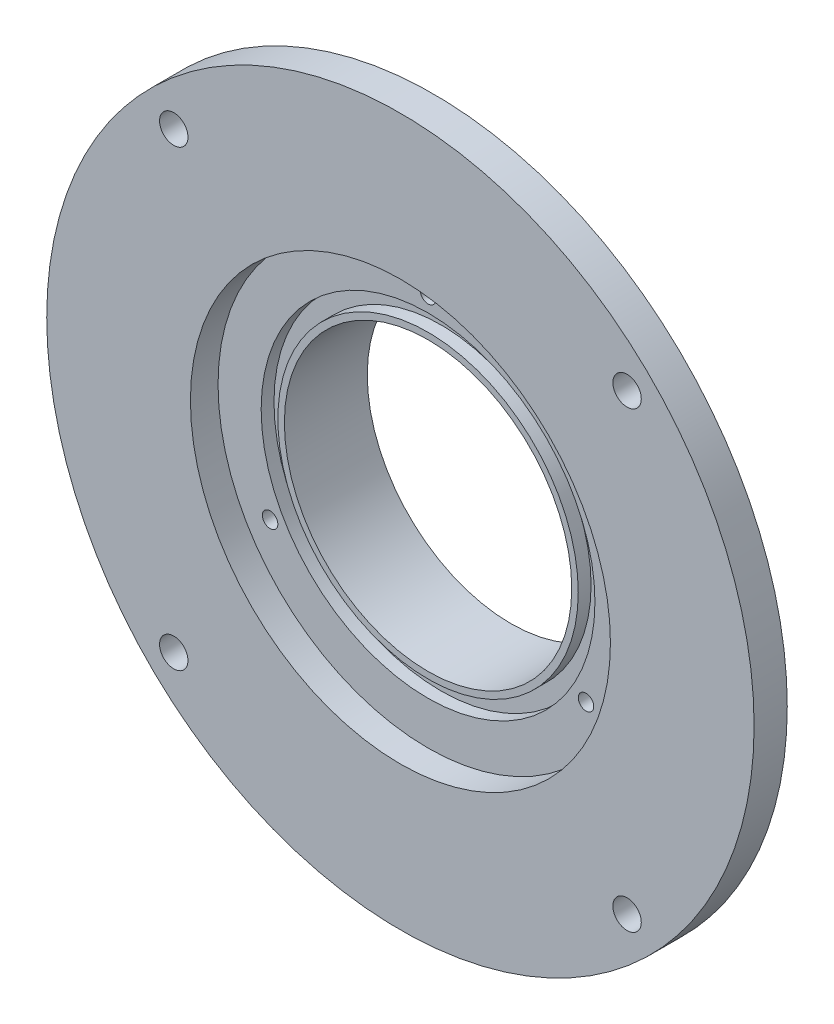
ISO-10303-21;
HEADER;
FILE_DESCRIPTION(('STEP AP214'),'2;1');
FILE_NAME('part.step','',(''),(''),'','','');
FILE_SCHEMA(('AUTOMOTIVE_DESIGN { 1 0 10303 214 1 1 1 1 }'));
ENDSEC;
DATA;
#1=APPLICATION_CONTEXT('core data for automotive mechanical design processes');
#2=APPLICATION_PROTOCOL_DEFINITION('international standard','automotive_design',2000,#1);
#3=PRODUCT_CONTEXT('',#1,'mechanical');
#4=PRODUCT('Part','Part','',(#3));
#5=PRODUCT_RELATED_PRODUCT_CATEGORY('part','',(#4));
#6=PRODUCT_DEFINITION_FORMATION('','',#4);
#7=PRODUCT_DEFINITION_CONTEXT('part definition',#1,'design');
#8=PRODUCT_DEFINITION('design','',#6,#7);
#9=PRODUCT_DEFINITION_SHAPE('','',#8);
#10=(LENGTH_UNIT() NAMED_UNIT(*) SI_UNIT(.MILLI.,.METRE.));
#11=(NAMED_UNIT(*) PLANE_ANGLE_UNIT() SI_UNIT($,.RADIAN.));
#12=(NAMED_UNIT(*) SI_UNIT($,.STERADIAN.) SOLID_ANGLE_UNIT());
#13=UNCERTAINTY_MEASURE_WITH_UNIT(LENGTH_MEASURE(1.E-05),#10,'distance_accuracy_value','');
#14=(GEOMETRIC_REPRESENTATION_CONTEXT(3) GLOBAL_UNCERTAINTY_ASSIGNED_CONTEXT((#13)) GLOBAL_UNIT_ASSIGNED_CONTEXT((#10,
#11,#12)) REPRESENTATION_CONTEXT('',''));
#15=CARTESIAN_POINT('',(0.,0.,0.));
#16=DIRECTION('',(0.,0.,1.));
#17=DIRECTION('',(1.,0.,0.));
#18=AXIS2_PLACEMENT_3D('',#15,#16,#17);
#19=CARTESIAN_POINT('',(0.,0.,0.635));
#20=DIRECTION('',(0.,0.,1.));
#21=DIRECTION('',(1.,0.,0.));
#22=AXIS2_PLACEMENT_3D('',#19,#20,#21);
#23=PLANE('',#22);
#24=CARTESIAN_POINT('',(0.,0.,0.635));
#25=DIRECTION('',(0.,0.,1.));
#26=DIRECTION('',(1.,0.,0.));
#27=AXIS2_PLACEMENT_3D('',#24,#25,#26);
#28=CIRCLE('',#27,16.51);
#29=CARTESIAN_POINT('',(16.51,0.,0.635));
#30=VERTEX_POINT('',#29);
#31=EDGE_CURVE('E44',#30,#30,#28,.F.);
#32=ORIENTED_EDGE('',*,*,#31,.T.);
#33=EDGE_LOOP('',(#32));
#34=FACE_BOUND('',#33,.T.);
#35=CARTESIAN_POINT('',(0.,0.,0.635));
#36=DIRECTION('',(0.,0.,1.));
#37=DIRECTION('',(1.,0.,0.));
#38=AXIS2_PLACEMENT_3D('',#35,#36,#37);
#39=CIRCLE('',#38,17.2593);
#40=CARTESIAN_POINT('',(17.2593,0.,0.635));
#41=VERTEX_POINT('',#40);
#42=EDGE_CURVE('E390',#41,#41,#39,.T.);
#43=ORIENTED_EDGE('',*,*,#42,.T.);
#44=EDGE_LOOP('',(#43));
#45=FACE_BOUND('',#44,.T.);
#46=ADVANCED_FACE('F40',(#34,#45),#23,.T.);
#47=CARTESIAN_POINT('',(0.,0.,-8.89));
#48=DIRECTION('',(0.,0.,1.));
#49=DIRECTION('',(1.,0.,0.));
#50=AXIS2_PLACEMENT_3D('',#47,#48,#49);
#51=CYLINDRICAL_SURFACE('',#50,16.51);
#52=CARTESIAN_POINT('',(0.,0.,-8.89));
#53=DIRECTION('',(0.,0.,1.));
#54=DIRECTION('',(1.,0.,0.));
#55=AXIS2_PLACEMENT_3D('',#52,#53,#54);
#56=CIRCLE('',#55,16.51);
#57=CARTESIAN_POINT('',(16.51,0.,-8.89));
#58=VERTEX_POINT('',#57);
#59=EDGE_CURVE('E94',#58,#58,#56,.T.);
#60=ORIENTED_EDGE('',*,*,#59,.F.);
#61=EDGE_LOOP('',(#60));
#62=FACE_BOUND('',#61,.T.);
#63=ORIENTED_EDGE('',*,*,#31,.F.);
#64=EDGE_LOOP('',(#63));
#65=FACE_BOUND('',#64,.T.);
#66=ADVANCED_FACE('F134',(#62,#65),#51,.F.);
#67=CARTESIAN_POINT('',(0.,0.,0.));
#68=DIRECTION('',(0.,0.,1.));
#69=DIRECTION('',(1.,0.,0.));
#70=AXIS2_PLACEMENT_3D('',#67,#68,#69);
#71=PLANE('',#70);
#72=CARTESIAN_POINT('',(26.0427427511005,26.0427427511006,0.));
#73=DIRECTION('',(0.,0.,1.));
#74=DIRECTION('',(1.,0.,0.));
#75=AXIS2_PLACEMENT_3D('',#72,#73,#74);
#76=CIRCLE('',#75,1.63195);
#77=CARTESIAN_POINT('',(27.6746927511005,26.0427427511006,0.));
#78=VERTEX_POINT('',#77);
#79=EDGE_CURVE('E100',#78,#78,#76,.T.);
#80=ORIENTED_EDGE('',*,*,#79,.T.);
#81=EDGE_LOOP('',(#80));
#82=FACE_BOUND('',#81,.T.);
#83=CARTESIAN_POINT('',(26.0427427511005,-26.0427427511006,0.));
#84=DIRECTION('',(0.,0.,1.));
#85=DIRECTION('',(1.,0.,0.));
#86=AXIS2_PLACEMENT_3D('',#83,#84,#85);
#87=CIRCLE('',#86,1.63195);
#88=CARTESIAN_POINT('',(27.6746927511005,-26.0427427511006,0.));
#89=VERTEX_POINT('',#88);
#90=EDGE_CURVE('E106',#89,#89,#87,.T.);
#91=ORIENTED_EDGE('',*,*,#90,.T.);
#92=EDGE_LOOP('',(#91));
#93=FACE_BOUND('',#92,.T.);
#94=CARTESIAN_POINT('',(-26.0422882155267,26.0431972787413,0.));
#95=DIRECTION('',(0.,0.,1.));
#96=DIRECTION('',(1.,0.,0.));
#97=AXIS2_PLACEMENT_3D('',#94,#95,#96);
#98=CIRCLE('',#97,1.63195);
#99=CARTESIAN_POINT('',(-24.4103382155267,26.0431972787413,0.));
#100=VERTEX_POINT('',#99);
#101=EDGE_CURVE('E112',#100,#100,#98,.T.);
#102=ORIENTED_EDGE('',*,*,#101,.T.);
#103=EDGE_LOOP('',(#102));
#104=FACE_BOUND('',#103,.T.);
#105=CARTESIAN_POINT('',(-26.0425154803386,-26.0429700198791,0.));
#106=DIRECTION('',(0.,0.,1.));
#107=DIRECTION('',(1.,0.,0.));
#108=AXIS2_PLACEMENT_3D('',#105,#106,#107);
#109=CIRCLE('',#108,1.63195);
#110=CARTESIAN_POINT('',(-24.4105654803386,-26.0429700198791,0.));
#111=VERTEX_POINT('',#110);
#112=EDGE_CURVE('E118',#111,#111,#109,.T.);
#113=ORIENTED_EDGE('',*,*,#112,.T.);
#114=EDGE_LOOP('',(#113));
#115=FACE_BOUND('',#114,.T.);
#116=CARTESIAN_POINT('',(0.,0.,0.));
#117=DIRECTION('',(0.,0.,1.));
#118=DIRECTION('',(1.,0.,0.));
#119=AXIS2_PLACEMENT_3D('',#116,#117,#118);
#120=CIRCLE('',#119,40.64);
#121=CARTESIAN_POINT('',(40.64,0.,0.));
#122=VERTEX_POINT('',#121);
#123=EDGE_CURVE('E124',#122,#122,#120,.T.);
#124=ORIENTED_EDGE('',*,*,#123,.F.);
#125=EDGE_LOOP('',(#124));
#126=FACE_BOUND('',#125,.T.);
#127=CARTESIAN_POINT('',(0.,0.,0.));
#128=DIRECTION('',(0.,0.,1.));
#129=DIRECTION('',(1.,0.,0.));
#130=AXIS2_PLACEMENT_3D('',#127,#128,#129);
#131=CIRCLE('',#130,27.94);
#132=CARTESIAN_POINT('',(27.94,0.,0.));
#133=VERTEX_POINT('',#132);
#134=EDGE_CURVE('E11',#133,#133,#131,.F.);
#135=ORIENTED_EDGE('',*,*,#134,.F.);
#136=EDGE_LOOP('',(#135));
#137=FACE_BOUND('',#136,.T.);
#138=ADVANCED_FACE('F131',(#82,#93,#104,#115,#126,#137),#71,.F.);
#139=CARTESIAN_POINT('',(0.,0.,3.81));
#140=DIRECTION('',(0.,0.,-1.));
#141=DIRECTION('',(-1.,0.,0.));
#142=AXIS2_PLACEMENT_3D('',#139,#140,#141);
#143=CYLINDRICAL_SURFACE('',#142,40.64);
#144=CARTESIAN_POINT('',(0.,0.,3.81));
#145=DIRECTION('',(0.,0.,1.));
#146=DIRECTION('',(1.,0.,0.));
#147=AXIS2_PLACEMENT_3D('',#144,#145,#146);
#148=CIRCLE('',#147,40.64);
#149=CARTESIAN_POINT('',(40.64,0.,3.81));
#150=VERTEX_POINT('',#149);
#151=EDGE_CURVE('E49',#150,#150,#148,.T.);
#152=ORIENTED_EDGE('',*,*,#151,.F.);
#153=EDGE_LOOP('',(#152));
#154=FACE_BOUND('',#153,.T.);
#155=ORIENTED_EDGE('',*,*,#123,.T.);
#156=EDGE_LOOP('',(#155));
#157=FACE_BOUND('',#156,.T.);
#158=ADVANCED_FACE('F42',(#154,#157),#143,.T.);
#159=CARTESIAN_POINT('',(0.,0.,3.81));
#160=DIRECTION('',(0.,0.,1.));
#161=DIRECTION('',(1.,0.,0.));
#162=AXIS2_PLACEMENT_3D('',#159,#160,#161);
#163=PLANE('',#162);
#164=CARTESIAN_POINT('',(0.,0.,3.81));
#165=DIRECTION('',(0.,0.,1.));
#166=DIRECTION('',(1.,0.,0.));
#167=AXIS2_PLACEMENT_3D('',#164,#165,#166);
#168=CIRCLE('',#167,24.13);
#169=CARTESIAN_POINT('',(24.13,0.,3.81));
#170=VERTEX_POINT('',#169);
#171=EDGE_CURVE('E88',#170,#170,#168,.T.);
#172=ORIENTED_EDGE('',*,*,#171,.F.);
#173=EDGE_LOOP('',(#172));
#174=FACE_BOUND('',#173,.T.);
#175=CARTESIAN_POINT('',(26.0427427511005,26.0427427511006,3.81));
#176=DIRECTION('',(0.,0.,1.));
#177=DIRECTION('',(1.,0.,0.));
#178=AXIS2_PLACEMENT_3D('',#175,#176,#177);
#179=CIRCLE('',#178,1.63195);
#180=CARTESIAN_POINT('',(27.6746927511005,26.0427427511006,3.81));
#181=VERTEX_POINT('',#180);
#182=EDGE_CURVE('E103',#181,#181,#179,.T.);
#183=ORIENTED_EDGE('',*,*,#182,.F.);
#184=EDGE_LOOP('',(#183));
#185=FACE_BOUND('',#184,.T.);
#186=CARTESIAN_POINT('',(26.0427427511005,-26.0427427511006,3.81));
#187=DIRECTION('',(0.,0.,1.));
#188=DIRECTION('',(1.,0.,0.));
#189=AXIS2_PLACEMENT_3D('',#186,#187,#188);
#190=CIRCLE('',#189,1.63195);
#191=CARTESIAN_POINT('',(27.6746927511005,-26.0427427511006,3.81));
#192=VERTEX_POINT('',#191);
#193=EDGE_CURVE('E109',#192,#192,#190,.T.);
#194=ORIENTED_EDGE('',*,*,#193,.F.);
#195=EDGE_LOOP('',(#194));
#196=FACE_BOUND('',#195,.T.);
#197=CARTESIAN_POINT('',(-26.0422882155267,26.0431972787413,3.81));
#198=DIRECTION('',(0.,0.,1.));
#199=DIRECTION('',(1.,0.,0.));
#200=AXIS2_PLACEMENT_3D('',#197,#198,#199);
#201=CIRCLE('',#200,1.63195);
#202=CARTESIAN_POINT('',(-24.4103382155267,26.0431972787413,3.81));
#203=VERTEX_POINT('',#202);
#204=EDGE_CURVE('E115',#203,#203,#201,.T.);
#205=ORIENTED_EDGE('',*,*,#204,.F.);
#206=EDGE_LOOP('',(#205));
#207=FACE_BOUND('',#206,.T.);
#208=CARTESIAN_POINT('',(-26.0425154803386,-26.0429700198791,3.81));
#209=DIRECTION('',(0.,0.,1.));
#210=DIRECTION('',(1.,0.,0.));
#211=AXIS2_PLACEMENT_3D('',#208,#209,#210);
#212=CIRCLE('',#211,1.63195);
#213=CARTESIAN_POINT('',(-24.4105654803386,-26.0429700198791,3.81));
#214=VERTEX_POINT('',#213);
#215=EDGE_CURVE('E121',#214,#214,#212,.T.);
#216=ORIENTED_EDGE('',*,*,#215,.F.);
#217=EDGE_LOOP('',(#216));
#218=FACE_BOUND('',#217,.T.);
#219=ORIENTED_EDGE('',*,*,#151,.T.);
#220=EDGE_LOOP('',(#219));
#221=FACE_BOUND('',#220,.T.);
#222=ADVANCED_FACE('F189',(#174,#185,#196,#207,#218,#221),#163,.T.);
#223=CARTESIAN_POINT('',(-26.0425154803386,-26.0429700198791,3.81));
#224=DIRECTION('',(0.,0.,1.));
#225=DIRECTION('',(1.,0.,0.));
#226=AXIS2_PLACEMENT_3D('',#223,#224,#225);
#227=CYLINDRICAL_SURFACE('',#226,1.63195);
#228=ORIENTED_EDGE('',*,*,#112,.F.);
#229=EDGE_LOOP('',(#228));
#230=FACE_BOUND('',#229,.T.);
#231=ORIENTED_EDGE('',*,*,#215,.T.);
#232=EDGE_LOOP('',(#231));
#233=FACE_BOUND('',#232,.T.);
#234=ADVANCED_FACE('F192',(#230,#233),#227,.F.);
#235=CARTESIAN_POINT('',(-26.0422882155267,26.0431972787413,3.81));
#236=DIRECTION('',(0.,0.,1.));
#237=DIRECTION('',(1.,0.,0.));
#238=AXIS2_PLACEMENT_3D('',#235,#236,#237);
#239=CYLINDRICAL_SURFACE('',#238,1.63195);
#240=ORIENTED_EDGE('',*,*,#101,.F.);
#241=EDGE_LOOP('',(#240));
#242=FACE_BOUND('',#241,.T.);
#243=ORIENTED_EDGE('',*,*,#204,.T.);
#244=EDGE_LOOP('',(#243));
#245=FACE_BOUND('',#244,.T.);
#246=ADVANCED_FACE('F221',(#242,#245),#239,.F.);
#247=CARTESIAN_POINT('',(26.0427427511005,-26.0427427511006,3.81));
#248=DIRECTION('',(0.,0.,1.));
#249=DIRECTION('',(1.,0.,0.));
#250=AXIS2_PLACEMENT_3D('',#247,#248,#249);
#251=CYLINDRICAL_SURFACE('',#250,1.63195);
#252=ORIENTED_EDGE('',*,*,#90,.F.);
#253=EDGE_LOOP('',(#252));
#254=FACE_BOUND('',#253,.T.);
#255=ORIENTED_EDGE('',*,*,#193,.T.);
#256=EDGE_LOOP('',(#255));
#257=FACE_BOUND('',#256,.T.);
#258=ADVANCED_FACE('F151',(#254,#257),#251,.F.);
#259=CARTESIAN_POINT('',(26.0427427511005,26.0427427511006,3.81));
#260=DIRECTION('',(0.,0.,1.));
#261=DIRECTION('',(1.,0.,0.));
#262=AXIS2_PLACEMENT_3D('',#259,#260,#261);
#263=CYLINDRICAL_SURFACE('',#262,1.63195);
#264=ORIENTED_EDGE('',*,*,#79,.F.);
#265=EDGE_LOOP('',(#264));
#266=FACE_BOUND('',#265,.T.);
#267=ORIENTED_EDGE('',*,*,#182,.T.);
#268=EDGE_LOOP('',(#267));
#269=FACE_BOUND('',#268,.T.);
#270=ADVANCED_FACE('F141',(#266,#269),#263,.F.);
#271=CARTESIAN_POINT('',(0.,0.,-8.89));
#272=DIRECTION('',(0.,0.,1.));
#273=DIRECTION('',(1.,0.,0.));
#274=AXIS2_PLACEMENT_3D('',#271,#272,#273);
#275=CYLINDRICAL_SURFACE('',#274,27.94);
#276=CARTESIAN_POINT('',(0.,0.,-8.89));
#277=DIRECTION('',(0.,0.,-1.));
#278=DIRECTION('',(-1.,0.,0.));
#279=AXIS2_PLACEMENT_3D('',#276,#277,#278);
#280=CIRCLE('',#279,27.94);
#281=CARTESIAN_POINT('',(-27.94,0.,-8.89));
#282=VERTEX_POINT('',#281);
#283=EDGE_CURVE('E97',#282,#282,#280,.T.);
#284=ORIENTED_EDGE('',*,*,#283,.F.);
#285=EDGE_LOOP('',(#284));
#286=FACE_BOUND('',#285,.T.);
#287=ORIENTED_EDGE('',*,*,#134,.T.);
#288=EDGE_LOOP('',(#287));
#289=FACE_BOUND('',#288,.T.);
#290=ADVANCED_FACE('F138',(#286,#289),#275,.T.);
#291=CARTESIAN_POINT('',(0.,0.,-8.89));
#292=DIRECTION('',(0.,0.,-1.));
#293=DIRECTION('',(-1.,0.,0.));
#294=AXIS2_PLACEMENT_3D('',#291,#292,#293);
#295=PLANE('',#294);
#296=ORIENTED_EDGE('',*,*,#59,.T.);
#297=EDGE_LOOP('',(#296));
#298=FACE_BOUND('',#297,.T.);
#299=ORIENTED_EDGE('',*,*,#283,.T.);
#300=EDGE_LOOP('',(#299));
#301=FACE_BOUND('',#300,.T.);
#302=ADVANCED_FACE('F140',(#298,#301),#295,.T.);
#303=CARTESIAN_POINT('',(0.,0.,0.635));
#304=DIRECTION('',(0.,0.,1.));
#305=DIRECTION('',(1.,0.,0.));
#306=AXIS2_PLACEMENT_3D('',#303,#304,#305);
#307=CIRCLE('',#306,19.177);
#308=CARTESIAN_POINT('',(19.177,0.,0.635));
#309=VERTEX_POINT('',#308);
#310=EDGE_CURVE('E178',#309,#309,#307,.T.);
#311=ORIENTED_EDGE('',*,*,#310,.F.);
#312=EDGE_LOOP('',(#311));
#313=FACE_BOUND('',#312,.T.);
#314=CARTESIAN_POINT('',(-18.147562336303,-10.4774999999998,0.635000000000001));
#315=DIRECTION('',(0.,0.,1.));
#316=DIRECTION('',(1.,0.,0.));
#317=AXIS2_PLACEMENT_3D('',#314,#315,#316);
#318=CIRCLE('',#317,0.888999999999987);
#319=CARTESIAN_POINT('',(-17.258562336303,-10.4774999999998,0.635000000000001));
#320=VERTEX_POINT('',#319);
#321=EDGE_CURVE('E70',#320,#320,#318,.T.);
#322=ORIENTED_EDGE('',*,*,#321,.F.);
#323=EDGE_LOOP('',(#322));
#324=FACE_BOUND('',#323,.T.);
#325=CARTESIAN_POINT('',(18.1475623363029,-10.4775000000001,0.635000000000001));
#326=DIRECTION('',(0.,0.,1.));
#327=DIRECTION('',(1.,0.,0.));
#328=AXIS2_PLACEMENT_3D('',#325,#326,#327);
#329=CIRCLE('',#328,0.888999999999987);
#330=CARTESIAN_POINT('',(19.0365623363029,-10.4775000000001,0.635000000000001));
#331=VERTEX_POINT('',#330);
#332=EDGE_CURVE('E69',#331,#331,#329,.T.);
#333=ORIENTED_EDGE('',*,*,#332,.F.);
#334=EDGE_LOOP('',(#333));
#335=FACE_BOUND('',#334,.T.);
#336=CARTESIAN_POINT('',(0.,20.955,0.635000000000001));
#337=DIRECTION('',(0.,0.,1.));
#338=DIRECTION('',(1.,0.,0.));
#339=AXIS2_PLACEMENT_3D('',#336,#337,#338);
#340=CIRCLE('',#339,0.888999999999989);
#341=CARTESIAN_POINT('',(0.888999999999989,20.955,0.635000000000001));
#342=VERTEX_POINT('',#341);
#343=EDGE_CURVE('E82',#342,#342,#340,.T.);
#344=ORIENTED_EDGE('',*,*,#343,.F.);
#345=EDGE_LOOP('',(#344));
#346=FACE_BOUND('',#345,.T.);
#347=CARTESIAN_POINT('',(0.,0.,0.635));
#348=DIRECTION('',(0.,0.,1.));
#349=DIRECTION('',(1.,0.,0.));
#350=AXIS2_PLACEMENT_3D('',#347,#348,#349);
#351=CIRCLE('',#350,24.13);
#352=CARTESIAN_POINT('',(24.13,0.,0.635));
#353=VERTEX_POINT('',#352);
#354=EDGE_CURVE('E89',#353,#353,#351,.T.);
#355=ORIENTED_EDGE('',*,*,#354,.T.);
#356=EDGE_LOOP('',(#355));
#357=FACE_BOUND('',#356,.T.);
#358=ADVANCED_FACE('F148',(#313,#324,#335,#346,#357),#23,.T.);
#359=CARTESIAN_POINT('',(0.,0.,0.635));
#360=DIRECTION('',(0.,0.,1.));
#361=DIRECTION('',(1.,0.,0.));
#362=AXIS2_PLACEMENT_3D('',#359,#360,#361);
#363=CYLINDRICAL_SURFACE('',#362,24.13);
#364=ORIENTED_EDGE('',*,*,#354,.F.);
#365=EDGE_LOOP('',(#364));
#366=FACE_BOUND('',#365,.T.);
#367=ORIENTED_EDGE('',*,*,#171,.T.);
#368=EDGE_LOOP('',(#367));
#369=FACE_BOUND('',#368,.T.);
#370=ADVANCED_FACE('F168',(#366,#369),#363,.F.);
#371=CARTESIAN_POINT('',(0.,20.955,-3.7846));
#372=DIRECTION('',(0.,0.,1.));
#373=DIRECTION('',(1.,0.,0.));
#374=AXIS2_PLACEMENT_3D('',#371,#372,#373);
#375=CONICAL_SURFACE('',#374,0.888999999999988,1.02974425867665);
#376=CARTESIAN_POINT('',(0.,20.955,-4.31876509031549));
#377=VERTEX_POINT('',#376);
#378=VERTEX_LOOP('',#377);
#379=FACE_BOUND('',#378,.T.);
#380=CARTESIAN_POINT('',(0.,20.955,-3.7846));
#381=DIRECTION('',(0.,0.,1.));
#382=DIRECTION('',(1.,0.,0.));
#383=AXIS2_PLACEMENT_3D('',#380,#381,#382);
#384=CIRCLE('',#383,0.888999999999988);
#385=CARTESIAN_POINT('',(0.888999999999988,20.955,-3.7846));
#386=VERTEX_POINT('',#385);
#387=EDGE_CURVE('E85',#386,#386,#384,.T.);
#388=ORIENTED_EDGE('',*,*,#387,.T.);
#389=EDGE_LOOP('',(#388));
#390=FACE_BOUND('',#389,.T.);
#391=ADVANCED_FACE('F173',(#379,#390),#375,.F.);
#392=CARTESIAN_POINT('',(0.,20.955,0.635));
#393=DIRECTION('',(0.,0.,1.));
#394=DIRECTION('',(1.,0.,0.));
#395=AXIS2_PLACEMENT_3D('',#392,#393,#394);
#396=CYLINDRICAL_SURFACE('',#395,0.888999999999988);
#397=ORIENTED_EDGE('',*,*,#387,.F.);
#398=EDGE_LOOP('',(#397));
#399=FACE_BOUND('',#398,.T.);
#400=ORIENTED_EDGE('',*,*,#343,.T.);
#401=EDGE_LOOP('',(#400));
#402=FACE_BOUND('',#401,.T.);
#403=ADVANCED_FACE('F279',(#399,#402),#396,.F.);
#404=CARTESIAN_POINT('',(18.1475623363029,-10.4775000000001,-3.7846));
#405=DIRECTION('',(0.,0.,1.));
#406=DIRECTION('',(1.,0.,0.));
#407=AXIS2_PLACEMENT_3D('',#404,#405,#406);
#408=CONICAL_SURFACE('',#407,0.888999999999987,1.02974425867665);
#409=CARTESIAN_POINT('',(18.1475623363029,-10.4775000000001,-4.31876509031549));
#410=VERTEX_POINT('',#409);
#411=VERTEX_LOOP('',#410);
#412=FACE_BOUND('',#411,.T.);
#413=CARTESIAN_POINT('',(18.1475623363029,-10.4775000000001,-3.7846));
#414=DIRECTION('',(0.,0.,1.));
#415=DIRECTION('',(1.,0.,0.));
#416=AXIS2_PLACEMENT_3D('',#413,#414,#415);
#417=CIRCLE('',#416,0.888999999999987);
#418=CARTESIAN_POINT('',(19.0365623363029,-10.4775000000001,-3.7846));
#419=VERTEX_POINT('',#418);
#420=EDGE_CURVE('E73',#419,#419,#417,.T.);
#421=ORIENTED_EDGE('',*,*,#420,.T.);
#422=EDGE_LOOP('',(#421));
#423=FACE_BOUND('',#422,.T.);
#424=ADVANCED_FACE('F286',(#412,#423),#408,.F.);
#425=CARTESIAN_POINT('',(18.1475623363029,-10.4775000000001,0.635));
#426=DIRECTION('',(0.,0.,1.));
#427=DIRECTION('',(1.,0.,0.));
#428=AXIS2_PLACEMENT_3D('',#425,#426,#427);
#429=CYLINDRICAL_SURFACE('',#428,0.888999999999987);
#430=ORIENTED_EDGE('',*,*,#420,.F.);
#431=EDGE_LOOP('',(#430));
#432=FACE_BOUND('',#431,.T.);
#433=ORIENTED_EDGE('',*,*,#332,.T.);
#434=EDGE_LOOP('',(#433));
#435=FACE_BOUND('',#434,.T.);
#436=ADVANCED_FACE('F63',(#432,#435),#429,.F.);
#437=CARTESIAN_POINT('',(-18.147562336303,-10.4774999999998,-3.7846));
#438=DIRECTION('',(0.,0.,1.));
#439=DIRECTION('',(1.,0.,0.));
#440=AXIS2_PLACEMENT_3D('',#437,#438,#439);
#441=CONICAL_SURFACE('',#440,0.888999999999987,1.02974425867665);
#442=CARTESIAN_POINT('',(-18.147562336303,-10.4774999999998,-4.31876509031549));
#443=VERTEX_POINT('',#442);
#444=VERTEX_LOOP('',#443);
#445=FACE_BOUND('',#444,.T.);
#446=CARTESIAN_POINT('',(-18.147562336303,-10.4774999999998,-3.7846));
#447=DIRECTION('',(0.,0.,1.));
#448=DIRECTION('',(1.,0.,0.));
#449=AXIS2_PLACEMENT_3D('',#446,#447,#448);
#450=CIRCLE('',#449,0.888999999999987);
#451=CARTESIAN_POINT('',(-17.258562336303,-10.4774999999998,-3.7846));
#452=VERTEX_POINT('',#451);
#453=EDGE_CURVE('E67',#452,#452,#450,.T.);
#454=ORIENTED_EDGE('',*,*,#453,.T.);
#455=EDGE_LOOP('',(#454));
#456=FACE_BOUND('',#455,.T.);
#457=ADVANCED_FACE('F59',(#445,#456),#441,.F.);
#458=CARTESIAN_POINT('',(-18.147562336303,-10.4774999999998,0.635));
#459=DIRECTION('',(0.,0.,1.));
#460=DIRECTION('',(1.,0.,0.));
#461=AXIS2_PLACEMENT_3D('',#458,#459,#460);
#462=CYLINDRICAL_SURFACE('',#461,0.888999999999987);
#463=ORIENTED_EDGE('',*,*,#453,.F.);
#464=EDGE_LOOP('',(#463));
#465=FACE_BOUND('',#464,.T.);
#466=ORIENTED_EDGE('',*,*,#321,.T.);
#467=EDGE_LOOP('',(#466));
#468=FACE_BOUND('',#467,.T.);
#469=ADVANCED_FACE('F62',(#465,#468),#462,.F.);
#470=CARTESIAN_POINT('',(0.,0.,-0.8382));
#471=DIRECTION('',(0.,0.,1.));
#472=DIRECTION('',(1.,0.,0.));
#473=AXIS2_PLACEMENT_3D('',#470,#471,#472);
#474=CYLINDRICAL_SURFACE('',#473,19.177);
#475=CARTESIAN_POINT('',(0.,0.,-0.8382));
#476=DIRECTION('',(0.,0.,1.));
#477=DIRECTION('',(1.,0.,0.));
#478=AXIS2_PLACEMENT_3D('',#475,#476,#477);
#479=CIRCLE('',#478,19.177);
#480=CARTESIAN_POINT('',(19.177,0.,-0.8382));
#481=VERTEX_POINT('',#480);
#482=EDGE_CURVE('E76',#481,#481,#479,.T.);
#483=ORIENTED_EDGE('',*,*,#482,.F.);
#484=EDGE_LOOP('',(#483));
#485=FACE_BOUND('',#484,.T.);
#486=ORIENTED_EDGE('',*,*,#310,.T.);
#487=EDGE_LOOP('',(#486));
#488=FACE_BOUND('',#487,.T.);
#489=ADVANCED_FACE('F317',(#485,#488),#474,.F.);
#490=CARTESIAN_POINT('',(0.,0.,-0.8382));
#491=DIRECTION('',(0.,0.,1.));
#492=DIRECTION('',(1.,0.,0.));
#493=AXIS2_PLACEMENT_3D('',#490,#491,#492);
#494=PLANE('',#493);
#495=CARTESIAN_POINT('',(0.,0.,-0.8382));
#496=DIRECTION('',(0.,0.,1.));
#497=DIRECTION('',(1.,0.,0.));
#498=AXIS2_PLACEMENT_3D('',#495,#496,#497);
#499=CIRCLE('',#498,17.2593);
#500=CARTESIAN_POINT('',(17.2593,0.,-0.8382));
#501=VERTEX_POINT('',#500);
#502=EDGE_CURVE('E387',#501,#501,#499,.T.);
#503=ORIENTED_EDGE('',*,*,#502,.F.);
#504=EDGE_LOOP('',(#503));
#505=FACE_BOUND('',#504,.T.);
#506=ORIENTED_EDGE('',*,*,#482,.T.);
#507=EDGE_LOOP('',(#506));
#508=FACE_BOUND('',#507,.T.);
#509=ADVANCED_FACE('F329',(#505,#508),#494,.T.);
#510=CARTESIAN_POINT('',(0.,0.,-0.8382));
#511=DIRECTION('',(0.,0.,1.));
#512=DIRECTION('',(1.,0.,0.));
#513=AXIS2_PLACEMENT_3D('',#510,#511,#512);
#514=CYLINDRICAL_SURFACE('',#513,17.2593);
#515=ORIENTED_EDGE('',*,*,#502,.T.);
#516=EDGE_LOOP('',(#515));
#517=FACE_BOUND('',#516,.T.);
#518=ORIENTED_EDGE('',*,*,#42,.F.);
#519=EDGE_LOOP('',(#518));
#520=FACE_BOUND('',#519,.T.);
#521=ADVANCED_FACE('F338',(#517,#520),#514,.T.);
#522=CLOSED_SHELL('',(#46,#66,#138,#158,#222,#234,#246,#258,#270,#290,#302,#358,#370,#391,#403,
#424,#436,#457,#469,#489,#509,#521));
#523=MANIFOLD_SOLID_BREP('B2',#522);
#524=ADVANCED_BREP_SHAPE_REPRESENTATION('',(#18,#523),#14);
#525=SHAPE_DEFINITION_REPRESENTATION(#9,#524);
ENDSEC;
END-ISO-10303-21;
